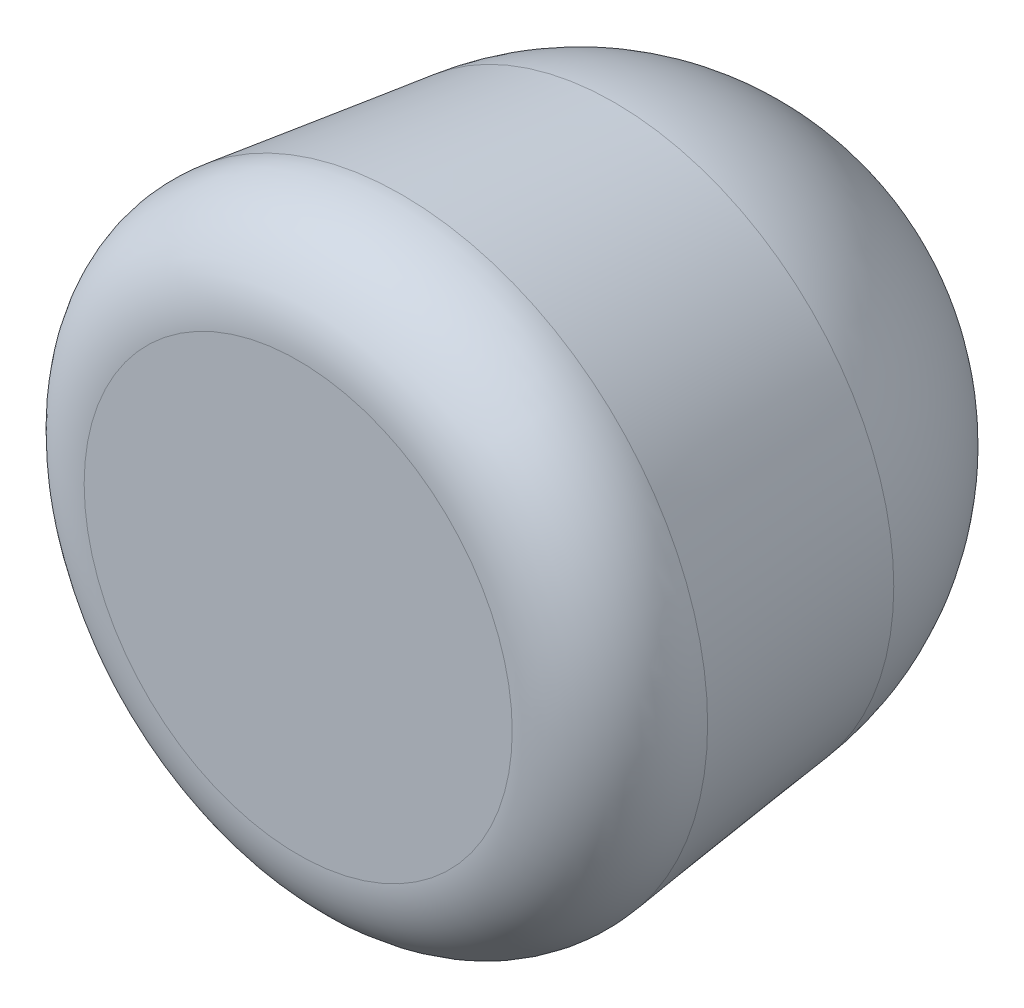
ISO-10303-21;
HEADER;
FILE_DESCRIPTION(('STEP AP214'),'2;1');
FILE_NAME('part.step','',(''),(''),'','','');
FILE_SCHEMA(('AUTOMOTIVE_DESIGN { 1 0 10303 214 1 1 1 1 }'));
ENDSEC;
DATA;
#1=APPLICATION_CONTEXT('core data for automotive mechanical design processes');
#2=APPLICATION_PROTOCOL_DEFINITION('international standard','automotive_design',2000,#1);
#3=PRODUCT_CONTEXT('',#1,'mechanical');
#4=PRODUCT('Part','Part','',(#3));
#5=PRODUCT_RELATED_PRODUCT_CATEGORY('part','',(#4));
#6=PRODUCT_DEFINITION_FORMATION('','',#4);
#7=PRODUCT_DEFINITION_CONTEXT('part definition',#1,'design');
#8=PRODUCT_DEFINITION('design','',#6,#7);
#9=PRODUCT_DEFINITION_SHAPE('','',#8);
#10=(LENGTH_UNIT() NAMED_UNIT(*) SI_UNIT(.MILLI.,.METRE.));
#11=(NAMED_UNIT(*) PLANE_ANGLE_UNIT() SI_UNIT($,.RADIAN.));
#12=(NAMED_UNIT(*) SI_UNIT($,.STERADIAN.) SOLID_ANGLE_UNIT());
#13=UNCERTAINTY_MEASURE_WITH_UNIT(LENGTH_MEASURE(1.E-05),#10,'distance_accuracy_value','');
#14=(GEOMETRIC_REPRESENTATION_CONTEXT(3) GLOBAL_UNCERTAINTY_ASSIGNED_CONTEXT((#13)) GLOBAL_UNIT_ASSIGNED_CONTEXT((#10,
#11,#12)) REPRESENTATION_CONTEXT('',''));
#15=CARTESIAN_POINT('',(0.,0.,0.));
#16=DIRECTION('',(0.,0.,1.));
#17=DIRECTION('',(1.,0.,0.));
#18=AXIS2_PLACEMENT_3D('',#15,#16,#17);
#19=CARTESIAN_POINT('',(0.,-1.09547938440952E-13,152.4));
#20=DIRECTION('',(0.,0.,-1.));
#21=DIRECTION('',(-1.,0.,0.));
#22=AXIS2_PLACEMENT_3D('',#19,#20,#21);
#23=PLANE('',#22);
#24=CARTESIAN_POINT('',(0.,0.,152.4));
#25=DIRECTION('',(0.,0.,1.));
#26=DIRECTION('',(1.,0.,0.));
#27=AXIS2_PLACEMENT_3D('',#24,#25,#26);
#28=CIRCLE('',#27,115.838320209974);
#29=CARTESIAN_POINT('',(115.838320209974,0.,152.4));
#30=VERTEX_POINT('',#29);
#31=EDGE_CURVE('E65',#30,#30,#28,.T.);
#32=ORIENTED_EDGE('',*,*,#31,.T.);
#33=EDGE_LOOP('',(#32));
#34=FACE_BOUND('',#33,.T.);
#35=ADVANCED_FACE('F39',(#34),#23,.F.);
#36=CARTESIAN_POINT('',(0.,0.,0.));
#37=DIRECTION('',(1.,0.,0.));
#38=DIRECTION('',(0.,0.,1.));
#39=AXIS2_PLACEMENT_3D('',#36,#37,#38);
#40=ELLIPSE('',#39,152.4,152.4);
#41=TRIMMED_CURVE('',#40,(PARAMETER_VALUE(3.14159265358979)),
(PARAMETER_VALUE(6.28318530717959)),.T.,.PARAMETER.);
#42=CARTESIAN_POINT('',(0.,0.,0.));
#43=DIRECTION('',(0.,0.,1.));
#44=AXIS1_PLACEMENT('',#42,#43);
#45=SURFACE_OF_REVOLUTION('',#41,#44);
#46=CARTESIAN_POINT('',(0.,0.,-18.6975782812869));
#47=DIRECTION('',(0.,0.,1.));
#48=DIRECTION('',(1.,0.,0.));
#49=AXIS2_PLACEMENT_3D('',#46,#47,#48);
#50=CIRCLE('',#49,151.248671288098);
#51=CARTESIAN_POINT('',(151.248671288098,0.,-18.6975782812869));
#52=VERTEX_POINT('',#51);
#53=EDGE_CURVE('E11',#52,#52,#50,.T.);
#54=ORIENTED_EDGE('',*,*,#53,.F.);
#55=EDGE_LOOP('',(#54));
#56=FACE_BOUND('',#55,.T.);
#57=CARTESIAN_POINT('',(0.,0.,-152.4));
#58=VERTEX_POINT('',#57);
#59=VERTEX_LOOP('',#58);
#60=FACE_BOUND('',#59,.T.);
#61=ADVANCED_FACE('F48',(#56,#60),#45,.T.);
#62=CARTESIAN_POINT('',(0.,0.,-18.6975782812869));
#63=DIRECTION('',(0.,0.,1.));
#64=DIRECTION('',(1.,0.,0.));
#65=AXIS2_PLACEMENT_3D('',#62,#63,#64);
#66=CONICAL_SURFACE('',#65,151.248671288098,0.122997411954247);
#67=CARTESIAN_POINT('',(0.,0.,96.2656239234624));
#68=DIRECTION('',(0.,0.,1.));
#69=DIRECTION('',(1.,0.,0.));
#70=AXIS2_PLACEMENT_3D('',#67,#68,#69);
#71=CIRCLE('',#70,165.460587692946);
#72=CARTESIAN_POINT('',(165.460587692946,0.,96.2656239234624));
#73=VERTEX_POINT('',#72);
#74=EDGE_CURVE('E45',#73,#73,#71,.T.);
#75=ORIENTED_EDGE('',*,*,#74,.F.);
#76=EDGE_LOOP('',(#75));
#77=FACE_BOUND('',#76,.T.);
#78=ORIENTED_EDGE('',*,*,#53,.T.);
#79=EDGE_LOOP('',(#78));
#80=FACE_BOUND('',#79,.T.);
#81=ADVANCED_FACE('F50',(#77,#80),#66,.T.);
#82=CARTESIAN_POINT('',(0.,0.,102.4));
#83=DIRECTION('',(0.,0.,1.));
#84=DIRECTION('',(1.,0.,0.));
#85=AXIS2_PLACEMENT_3D('',#82,#83,#84);
#86=TOROIDAL_SURFACE('',#85,115.838320209974,50.);
#87=ORIENTED_EDGE('',*,*,#31,.F.);
#88=EDGE_LOOP('',(#87));
#89=FACE_BOUND('',#88,.T.);
#90=ORIENTED_EDGE('',*,*,#74,.T.);
#91=EDGE_LOOP('',(#90));
#92=FACE_BOUND('',#91,.T.);
#93=ADVANCED_FACE('F56',(#89,#92),#86,.T.);
#94=CLOSED_SHELL('',(#35,#61,#81,#93));
#95=MANIFOLD_SOLID_BREP('B2',#94);
#96=ADVANCED_BREP_SHAPE_REPRESENTATION('',(#18,#95),#14);
#97=SHAPE_DEFINITION_REPRESENTATION(#9,#96);
ENDSEC;
END-ISO-10303-21;
